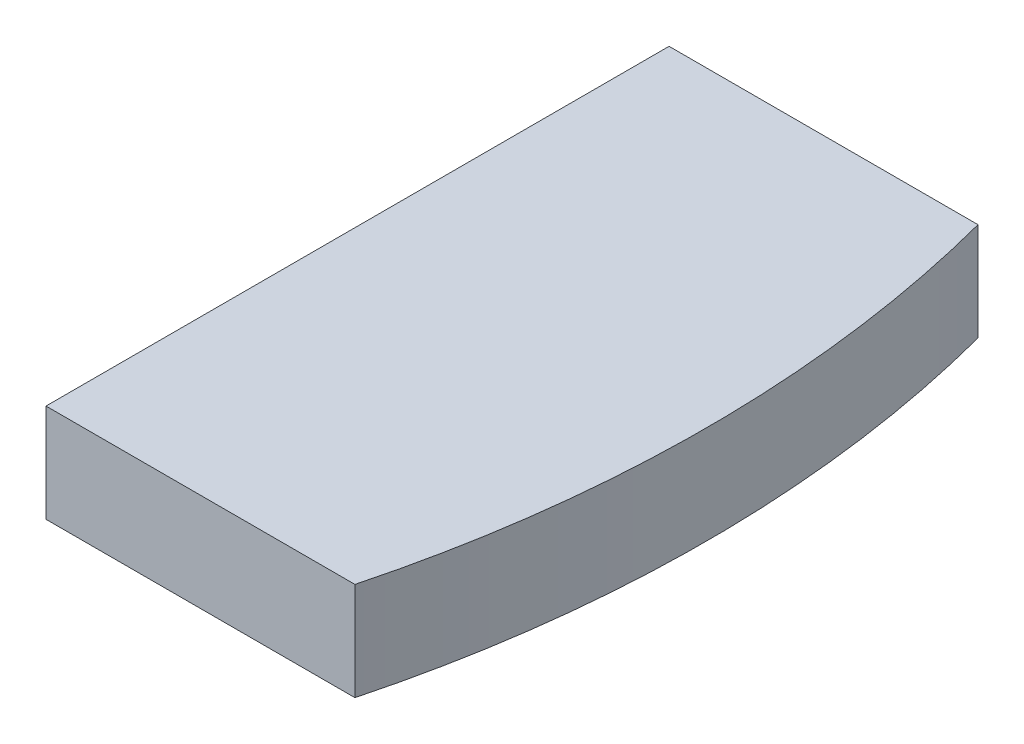
ISO-10303-21;
HEADER;
FILE_DESCRIPTION(('STEP AP214'),'2;1');
FILE_NAME('part.step','',(''),(''),'','','');
FILE_SCHEMA(('AUTOMOTIVE_DESIGN { 1 0 10303 214 1 1 1 1 }'));
ENDSEC;
DATA;
#1=APPLICATION_CONTEXT('core data for automotive mechanical design processes');
#2=APPLICATION_PROTOCOL_DEFINITION('international standard','automotive_design',2000,#1);
#3=PRODUCT_CONTEXT('',#1,'mechanical');
#4=PRODUCT('Part','Part','',(#3));
#5=PRODUCT_RELATED_PRODUCT_CATEGORY('part','',(#4));
#6=PRODUCT_DEFINITION_FORMATION('','',#4);
#7=PRODUCT_DEFINITION_CONTEXT('part definition',#1,'design');
#8=PRODUCT_DEFINITION('design','',#6,#7);
#9=PRODUCT_DEFINITION_SHAPE('','',#8);
#10=(LENGTH_UNIT() NAMED_UNIT(*) SI_UNIT(.MILLI.,.METRE.));
#11=(NAMED_UNIT(*) PLANE_ANGLE_UNIT() SI_UNIT($,.RADIAN.));
#12=(NAMED_UNIT(*) SI_UNIT($,.STERADIAN.) SOLID_ANGLE_UNIT());
#13=UNCERTAINTY_MEASURE_WITH_UNIT(LENGTH_MEASURE(1.E-05),#10,'distance_accuracy_value','');
#14=(GEOMETRIC_REPRESENTATION_CONTEXT(3) GLOBAL_UNCERTAINTY_ASSIGNED_CONTEXT((#13)) GLOBAL_UNIT_ASSIGNED_CONTEXT((#10,
#11,#12)) REPRESENTATION_CONTEXT('',''));
#15=CARTESIAN_POINT('',(0.,0.,0.));
#16=DIRECTION('',(0.,0.,1.));
#17=DIRECTION('',(1.,0.,0.));
#18=AXIS2_PLACEMENT_3D('',#15,#16,#17);
#19=CARTESIAN_POINT('',(0.,12.,0.));
#20=DIRECTION('',(0.,1.,0.));
#21=DIRECTION('',(0.,0.,1.));
#22=AXIS2_PLACEMENT_3D('',#19,#20,#21);
#23=PLANE('',#22);
#24=DIRECTION('',(0.,0.,1.));
#25=VECTOR('',#24,1.);
#26=CARTESIAN_POINT('',(107.3,12.,0.));
#27=LINE('',#26,#25);
#28=CARTESIAN_POINT('',(107.3,12.,-38.1));
#29=VERTEX_POINT('',#28);
#30=CARTESIAN_POINT('',(107.3,12.,38.1));
#31=VERTEX_POINT('',#30);
#32=EDGE_CURVE('E85',#29,#31,#27,.T.);
#33=ORIENTED_EDGE('',*,*,#32,.T.);
#34=DIRECTION('',(1.,0.,0.));
#35=VECTOR('',#34,1.);
#36=CARTESIAN_POINT('',(0.,12.,38.1));
#37=LINE('',#36,#35);
#38=CARTESIAN_POINT('',(145.080632752963,12.,38.1));
#39=VERTEX_POINT('',#38);
#40=EDGE_CURVE('E100',#31,#39,#37,.T.);
#41=ORIENTED_EDGE('',*,*,#40,.T.);
#42=CARTESIAN_POINT('',(0.,12.,0.));
#43=DIRECTION('',(0.,1.,0.));
#44=DIRECTION('',(0.,0.,1.));
#45=AXIS2_PLACEMENT_3D('',#42,#43,#44);
#46=CIRCLE('',#45,150.);
#47=CARTESIAN_POINT('',(145.080632752963,12.,-38.1));
#48=VERTEX_POINT('',#47);
#49=EDGE_CURVE('E11',#39,#48,#46,.T.);
#50=ORIENTED_EDGE('',*,*,#49,.T.);
#51=DIRECTION('',(1.,0.,0.));
#52=VECTOR('',#51,1.);
#53=CARTESIAN_POINT('',(0.,12.,-38.1));
#54=LINE('',#53,#52);
#55=EDGE_CURVE('E50',#29,#48,#54,.T.);
#56=ORIENTED_EDGE('',*,*,#55,.F.);
#57=EDGE_LOOP('',(#33,#41,#50,#56));
#58=FACE_BOUND('',#57,.T.);
#59=ADVANCED_FACE('F35',(#58),#23,.T.);
#60=CARTESIAN_POINT('',(0.,0.,0.));
#61=DIRECTION('',(0.,1.,0.));
#62=DIRECTION('',(0.,0.,1.));
#63=AXIS2_PLACEMENT_3D('',#60,#61,#62);
#64=PLANE('',#63);
#65=DIRECTION('',(1.,0.,0.));
#66=VECTOR('',#65,1.);
#67=CARTESIAN_POINT('',(0.,0.,38.1));
#68=LINE('',#67,#66);
#69=CARTESIAN_POINT('',(107.3,0.,38.1));
#70=VERTEX_POINT('',#69);
#71=CARTESIAN_POINT('',(145.080632752963,0.,38.1));
#72=VERTEX_POINT('',#71);
#73=EDGE_CURVE('E59',#70,#72,#68,.T.);
#74=ORIENTED_EDGE('',*,*,#73,.F.);
#75=DIRECTION('',(0.,0.,1.));
#76=VECTOR('',#75,1.);
#77=CARTESIAN_POINT('',(107.3,0.,0.));
#78=LINE('',#77,#76);
#79=CARTESIAN_POINT('',(107.3,0.,-38.1));
#80=VERTEX_POINT('',#79);
#81=EDGE_CURVE('E79',#80,#70,#78,.T.);
#82=ORIENTED_EDGE('',*,*,#81,.F.);
#83=DIRECTION('',(1.,0.,0.));
#84=VECTOR('',#83,1.);
#85=CARTESIAN_POINT('',(0.,0.,-38.1));
#86=LINE('',#85,#84);
#87=CARTESIAN_POINT('',(145.080632752963,0.,-38.1));
#88=VERTEX_POINT('',#87);
#89=EDGE_CURVE('E90',#80,#88,#86,.T.);
#90=ORIENTED_EDGE('',*,*,#89,.T.);
#91=CARTESIAN_POINT('',(0.,0.,0.));
#92=DIRECTION('',(0.,1.,0.));
#93=DIRECTION('',(0.,0.,1.));
#94=AXIS2_PLACEMENT_3D('',#91,#92,#93);
#95=CIRCLE('',#94,150.);
#96=EDGE_CURVE('E39',#72,#88,#95,.T.);
#97=ORIENTED_EDGE('',*,*,#96,.F.);
#98=EDGE_LOOP('',(#74,#82,#90,#97));
#99=FACE_BOUND('',#98,.T.);
#100=ADVANCED_FACE('F96',(#99),#64,.F.);
#101=CARTESIAN_POINT('',(0.,12.,0.));
#102=DIRECTION('',(0.,-1.,0.));
#103=DIRECTION('',(0.,0.,-1.));
#104=AXIS2_PLACEMENT_3D('',#101,#102,#103);
#105=CYLINDRICAL_SURFACE('',#104,150.);
#106=DIRECTION('',(0.,1.,0.));
#107=VECTOR('',#106,1.);
#108=CARTESIAN_POINT('',(145.080632752963,0.,38.1));
#109=LINE('',#108,#107);
#110=EDGE_CURVE('E72',#72,#39,#109,.T.);
#111=ORIENTED_EDGE('',*,*,#110,.F.);
#112=ORIENTED_EDGE('',*,*,#96,.T.);
#113=DIRECTION('',(0.,1.,0.));
#114=VECTOR('',#113,1.);
#115=CARTESIAN_POINT('',(145.080632752963,0.,-38.1));
#116=LINE('',#115,#114);
#117=EDGE_CURVE('E86',#88,#48,#116,.T.);
#118=ORIENTED_EDGE('',*,*,#117,.T.);
#119=ORIENTED_EDGE('',*,*,#49,.F.);
#120=EDGE_LOOP('',(#111,#112,#118,#119));
#121=FACE_BOUND('',#120,.T.);
#122=ADVANCED_FACE('F37',(#121),#105,.T.);
#123=CARTESIAN_POINT('',(0.,0.,38.1));
#124=DIRECTION('',(0.,0.,1.));
#125=DIRECTION('',(1.,0.,0.));
#126=AXIS2_PLACEMENT_3D('',#123,#124,#125);
#127=PLANE('',#126);
#128=ORIENTED_EDGE('',*,*,#40,.F.);
#129=DIRECTION('',(0.,1.,0.));
#130=VECTOR('',#129,1.);
#131=CARTESIAN_POINT('',(107.3,0.,38.1));
#132=LINE('',#131,#130);
#133=EDGE_CURVE('E87',#70,#31,#132,.T.);
#134=ORIENTED_EDGE('',*,*,#133,.F.);
#135=ORIENTED_EDGE('',*,*,#73,.T.);
#136=ORIENTED_EDGE('',*,*,#110,.T.);
#137=EDGE_LOOP('',(#128,#134,#135,#136));
#138=FACE_BOUND('',#137,.T.);
#139=ADVANCED_FACE('F106',(#138),#127,.T.);
#140=CARTESIAN_POINT('',(0.,0.,-38.1));
#141=DIRECTION('',(0.,0.,1.));
#142=DIRECTION('',(1.,0.,0.));
#143=AXIS2_PLACEMENT_3D('',#140,#141,#142);
#144=PLANE('',#143);
#145=ORIENTED_EDGE('',*,*,#55,.T.);
#146=ORIENTED_EDGE('',*,*,#117,.F.);
#147=ORIENTED_EDGE('',*,*,#89,.F.);
#148=DIRECTION('',(0.,1.,0.));
#149=VECTOR('',#148,1.);
#150=CARTESIAN_POINT('',(107.3,0.,-38.1));
#151=LINE('',#150,#149);
#152=EDGE_CURVE('E81',#80,#29,#151,.T.);
#153=ORIENTED_EDGE('',*,*,#152,.T.);
#154=EDGE_LOOP('',(#145,#146,#147,#153));
#155=FACE_BOUND('',#154,.T.);
#156=ADVANCED_FACE('F91',(#155),#144,.F.);
#157=CARTESIAN_POINT('',(107.3,0.,0.));
#158=DIRECTION('',(-1.,0.,0.));
#159=DIRECTION('',(0.,0.,1.));
#160=AXIS2_PLACEMENT_3D('',#157,#158,#159);
#161=PLANE('',#160);
#162=ORIENTED_EDGE('',*,*,#32,.F.);
#163=ORIENTED_EDGE('',*,*,#152,.F.);
#164=ORIENTED_EDGE('',*,*,#81,.T.);
#165=ORIENTED_EDGE('',*,*,#133,.T.);
#166=EDGE_LOOP('',(#162,#163,#164,#165));
#167=FACE_BOUND('',#166,.T.);
#168=ADVANCED_FACE('F83',(#167),#161,.T.);
#169=CLOSED_SHELL('',(#59,#100,#122,#139,#156,#168));
#170=MANIFOLD_SOLID_BREP('B2',#169);
#171=ADVANCED_BREP_SHAPE_REPRESENTATION('',(#18,#170),#14);
#172=SHAPE_DEFINITION_REPRESENTATION(#9,#171);
ENDSEC;
END-ISO-10303-21;
